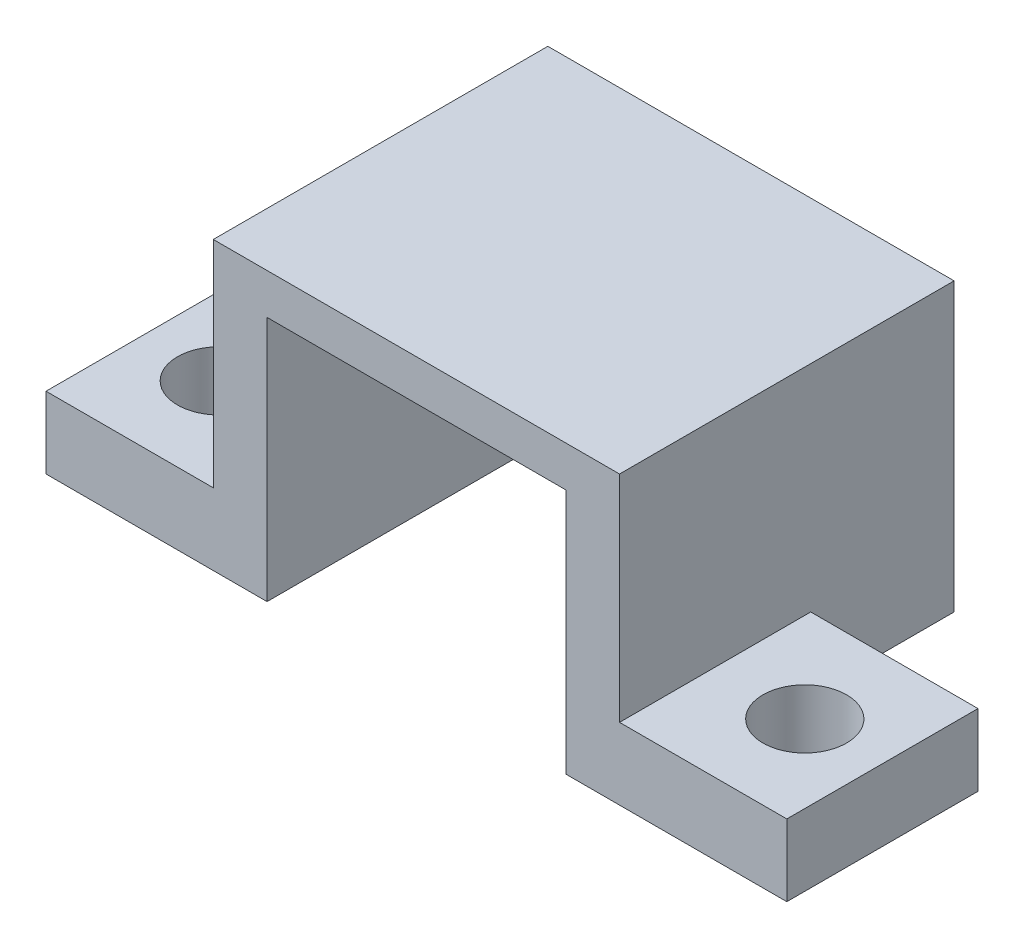
ISO-10303-21;
HEADER;
FILE_DESCRIPTION(('STEP AP214'),'2;1');
FILE_NAME('part.step','',(''),(''),'','','');
FILE_SCHEMA(('AUTOMOTIVE_DESIGN { 1 0 10303 214 1 1 1 1 }'));
ENDSEC;
DATA;
#1=APPLICATION_CONTEXT('core data for automotive mechanical design processes');
#2=APPLICATION_PROTOCOL_DEFINITION('international standard','automotive_design',2000,#1);
#3=PRODUCT_CONTEXT('',#1,'mechanical');
#4=PRODUCT('Part','Part','',(#3));
#5=PRODUCT_RELATED_PRODUCT_CATEGORY('part','',(#4));
#6=PRODUCT_DEFINITION_FORMATION('','',#4);
#7=PRODUCT_DEFINITION_CONTEXT('part definition',#1,'design');
#8=PRODUCT_DEFINITION('design','',#6,#7);
#9=PRODUCT_DEFINITION_SHAPE('','',#8);
#10=(LENGTH_UNIT() NAMED_UNIT(*) SI_UNIT(.MILLI.,.METRE.));
#11=(NAMED_UNIT(*) PLANE_ANGLE_UNIT() SI_UNIT($,.RADIAN.));
#12=(NAMED_UNIT(*) SI_UNIT($,.STERADIAN.) SOLID_ANGLE_UNIT());
#13=UNCERTAINTY_MEASURE_WITH_UNIT(LENGTH_MEASURE(1.E-05),#10,'distance_accuracy_value','');
#14=(GEOMETRIC_REPRESENTATION_CONTEXT(3) GLOBAL_UNCERTAINTY_ASSIGNED_CONTEXT((#13)) GLOBAL_UNIT_ASSIGNED_CONTEXT((#10,
#11,#12)) REPRESENTATION_CONTEXT('',''));
#15=CARTESIAN_POINT('',(0.,0.,0.));
#16=DIRECTION('',(0.,0.,1.));
#17=DIRECTION('',(1.,0.,0.));
#18=AXIS2_PLACEMENT_3D('',#15,#16,#17);
#19=CARTESIAN_POINT('',(0.,5.00000041370185E-05,0.));
#20=DIRECTION('',(0.,-1.,0.));
#21=DIRECTION('',(0.,0.,-1.));
#22=AXIS2_PLACEMENT_3D('',#19,#20,#21);
#23=PLANE('',#22);
#24=CARTESIAN_POINT('',(3.25002521276474,5.00000041370185E-05,10.0000251680613));
#25=DIRECTION('',(0.,-1.,0.));
#26=DIRECTION('',(0.,0.,-1.));
#27=AXIS2_PLACEMENT_3D('',#24,#25,#26);
#28=CIRCLE('',#27,1.75);
#29=CARTESIAN_POINT('',(3.25002521276474,5.00000041370185E-05,8.25002516806126));
#30=VERTEX_POINT('',#29);
#31=EDGE_CURVE('E161',#30,#30,#28,.T.);
#32=ORIENTED_EDGE('',*,*,#31,.F.);
#33=EDGE_LOOP('',(#32));
#34=FACE_BOUND('',#33,.T.);
#35=DIRECTION('',(0.,0.,1.));
#36=VECTOR('',#35,1.);
#37=CARTESIAN_POINT('',(9.25002433359623,5.00000041370185E-05,2.46800482273102E-05));
#38=LINE('',#37,#36);
#39=CARTESIAN_POINT('',(9.25002433359623,5.00000041370185E-05,2.46800482273102E-05));
#40=VERTEX_POINT('',#39);
#41=CARTESIAN_POINT('',(9.25002433359623,5.00000041370185E-05,14.0000246465206));
#42=VERTEX_POINT('',#41);
#43=EDGE_CURVE('E208',#40,#42,#38,.T.);
#44=ORIENTED_EDGE('',*,*,#43,.T.);
#45=DIRECTION('',(-1.,0.,0.));
#46=VECTOR('',#45,1.);
#47=CARTESIAN_POINT('',(24.0000262856483,5.00000041370185E-05,14.0000246465206));
#48=LINE('',#47,#46);
#49=CARTESIAN_POINT('',(2.51457095146179E-05,5.00000041369643E-05,14.0000246465206));
#50=VERTEX_POINT('',#49);
#51=EDGE_CURVE('E242',#42,#50,#48,.T.);
#52=ORIENTED_EDGE('',*,*,#51,.T.);
#53=DIRECTION('',(0.,0.,1.));
#54=VECTOR('',#53,1.);
#55=CARTESIAN_POINT('',(2.51457095146179E-05,5.00000041369643E-05,14.0000246465206));
#56=LINE('',#55,#54);
#57=CARTESIAN_POINT('',(2.51457095154853E-05,5.00000041368017E-05,6.00002473220229));
#58=VERTEX_POINT('',#57);
#59=EDGE_CURVE('E178',#58,#50,#56,.T.);
#60=ORIENTED_EDGE('',*,*,#59,.F.);
#61=DIRECTION('',(1.,0.,0.));
#62=VECTOR('',#61,1.);
#63=CARTESIAN_POINT('',(2.51457095154853E-05,5.00000041368017E-05,6.00002473220229));
#64=LINE('',#63,#62);
#65=CARTESIAN_POINT('',(7.00002443045378,5.00000041368017E-05,6.00002473220229));
#66=VERTEX_POINT('',#65);
#67=EDGE_CURVE('E191',#58,#66,#64,.T.);
#68=ORIENTED_EDGE('',*,*,#67,.T.);
#69=DIRECTION('',(0.,0.,-1.));
#70=VECTOR('',#69,1.);
#71=CARTESIAN_POINT('',(7.00002443045378,5.00000041370185E-05,14.0000246465206));
#72=LINE('',#71,#70);
#73=CARTESIAN_POINT('',(7.00002443045378,5.00000041370185E-05,2.46800482273102E-05));
#74=VERTEX_POINT('',#73);
#75=EDGE_CURVE('E228',#66,#74,#72,.T.);
#76=ORIENTED_EDGE('',*,*,#75,.T.);
#77=DIRECTION('',(1.,0.,0.));
#78=VECTOR('',#77,1.);
#79=CARTESIAN_POINT('',(7.00002443045378,5.00000041370185E-05,2.46800482273102E-05));
#80=LINE('',#79,#78);
#81=EDGE_CURVE('E237',#74,#40,#80,.T.);
#82=ORIENTED_EDGE('',*,*,#81,.T.);
#83=EDGE_LOOP('',(#44,#52,#60,#68,#76,#82));
#84=FACE_BOUND('',#83,.T.);
#85=ADVANCED_FACE('F34',(#34,#84),#23,.T.);
#86=CARTESIAN_POINT('',(7.00002443045378,12.0000503957272,2.46800482273102E-05));
#87=DIRECTION('',(0.,0.,-1.));
#88=DIRECTION('',(-1.,0.,0.));
#89=AXIS2_PLACEMENT_3D('',#86,#87,#88);
#90=PLANE('',#89);
#91=DIRECTION('',(0.,-1.,0.));
#92=VECTOR('',#91,1.);
#93=CARTESIAN_POINT('',(9.25002433359623,10.3000504896045,2.46800482273102E-05));
#94=LINE('',#93,#92);
#95=CARTESIAN_POINT('',(9.25002433359623,10.3000504896045,2.46800482273102E-05));
#96=VERTEX_POINT('',#95);
#97=EDGE_CURVE('E198',#96,#40,#94,.T.);
#98=ORIENTED_EDGE('',*,*,#97,.T.);
#99=ORIENTED_EDGE('',*,*,#81,.F.);
#100=DIRECTION('',(0.,-1.,0.));
#101=VECTOR('',#100,1.);
#102=CARTESIAN_POINT('',(7.00002443045378,12.0000503957272,2.46800482273102E-05));
#103=LINE('',#102,#101);
#104=CARTESIAN_POINT('',(7.00002443045378,12.0000503957272,2.46800482273102E-05));
#105=VERTEX_POINT('',#104);
#106=EDGE_CURVE('E11',#105,#74,#103,.T.);
#107=ORIENTED_EDGE('',*,*,#106,.F.);
#108=DIRECTION('',(1.,0.,0.));
#109=VECTOR('',#108,1.);
#110=CARTESIAN_POINT('',(7.00002443045378,12.0000503957272,2.46800482273102E-05));
#111=LINE('',#110,#109);
#112=CARTESIAN_POINT('',(24.0000262856483,12.0000503957272,2.46800482273102E-05));
#113=VERTEX_POINT('',#112);
#114=EDGE_CURVE('E224',#105,#113,#111,.T.);
#115=ORIENTED_EDGE('',*,*,#114,.T.);
#116=DIRECTION('',(0.,-1.,0.));
#117=VECTOR('',#116,1.);
#118=CARTESIAN_POINT('',(24.0000262856483,12.0000503957272,2.46800482273102E-05));
#119=LINE('',#118,#117);
#120=CARTESIAN_POINT('',(24.0000262856483,5.00000041370185E-05,2.46800482273102E-05));
#121=VERTEX_POINT('',#120);
#122=EDGE_CURVE('E236',#113,#121,#119,.T.);
#123=ORIENTED_EDGE('',*,*,#122,.T.);
#124=CARTESIAN_POINT('',(21.7500254511833,5.00000041370185E-05,2.46800482273102E-05));
#125=VERTEX_POINT('',#124);
#126=EDGE_CURVE('E217',#125,#121,#80,.T.);
#127=ORIENTED_EDGE('',*,*,#126,.F.);
#128=DIRECTION('',(0.,1.,0.));
#129=VECTOR('',#128,1.);
#130=CARTESIAN_POINT('',(21.7500254511833,5.00000041369914E-05,2.46800482273102E-05));
#131=LINE('',#130,#129);
#132=CARTESIAN_POINT('',(21.7500254511833,10.3000504896045,2.46800482273102E-05));
#133=VERTEX_POINT('',#132);
#134=EDGE_CURVE('E201',#125,#133,#131,.T.);
#135=ORIENTED_EDGE('',*,*,#134,.T.);
#136=DIRECTION('',(-1.,0.,0.));
#137=VECTOR('',#136,1.);
#138=CARTESIAN_POINT('',(21.7500254511833,10.3000504896045,2.46800482273102E-05));
#139=LINE('',#138,#137);
#140=EDGE_CURVE('E205',#133,#96,#139,.T.);
#141=ORIENTED_EDGE('',*,*,#140,.T.);
#142=EDGE_LOOP('',(#98,#99,#107,#115,#123,#127,#135,#141));
#143=FACE_BOUND('',#142,.T.);
#144=ADVANCED_FACE('F36',(#143),#90,.T.);
#145=CARTESIAN_POINT('',(7.00002443045378,12.0000503957272,14.0000246465206));
#146=DIRECTION('',(-1.,0.,0.));
#147=DIRECTION('',(0.,0.,1.));
#148=AXIS2_PLACEMENT_3D('',#145,#146,#147);
#149=PLANE('',#148);
#150=DIRECTION('',(0.,0.,-1.));
#151=VECTOR('',#150,1.);
#152=CARTESIAN_POINT('',(7.00002443045378,3.00005008466542,6.00002473220229));
#153=LINE('',#152,#151);
#154=CARTESIAN_POINT('',(7.00002443045378,3.00005008466542,14.0000246465206));
#155=VERTEX_POINT('',#154);
#156=CARTESIAN_POINT('',(7.00002443045378,3.00005008466542,6.00002473220229));
#157=VERTEX_POINT('',#156);
#158=EDGE_CURVE('E184',#155,#157,#153,.T.);
#159=ORIENTED_EDGE('',*,*,#158,.F.);
#160=DIRECTION('',(0.,-1.,0.));
#161=VECTOR('',#160,1.);
#162=CARTESIAN_POINT('',(7.00002443045378,12.0000503957272,14.0000246465206));
#163=LINE('',#162,#161);
#164=CARTESIAN_POINT('',(7.00002443045378,12.0000503957272,14.0000246465206));
#165=VERTEX_POINT('',#164);
#166=EDGE_CURVE('E43',#165,#155,#163,.T.);
#167=ORIENTED_EDGE('',*,*,#166,.F.);
#168=DIRECTION('',(0.,0.,-1.));
#169=VECTOR('',#168,1.);
#170=CARTESIAN_POINT('',(7.00002443045378,12.0000503957272,14.0000246465206));
#171=LINE('',#170,#169);
#172=EDGE_CURVE('E233',#165,#105,#171,.T.);
#173=ORIENTED_EDGE('',*,*,#172,.T.);
#174=ORIENTED_EDGE('',*,*,#106,.T.);
#175=ORIENTED_EDGE('',*,*,#75,.F.);
#176=DIRECTION('',(0.,-1.,0.));
#177=VECTOR('',#176,1.);
#178=CARTESIAN_POINT('',(7.00002443045378,5.00000041368017E-05,6.00002473220229));
#179=LINE('',#178,#177);
#180=EDGE_CURVE('E176',#157,#66,#179,.T.);
#181=ORIENTED_EDGE('',*,*,#180,.F.);
#182=EDGE_LOOP('',(#159,#167,#173,#174,#175,#181));
#183=FACE_BOUND('',#182,.T.);
#184=ADVANCED_FACE('F277',(#183),#149,.T.);
#185=CARTESIAN_POINT('',(24.0000262856483,12.0000503957272,14.0000246465206));
#186=DIRECTION('',(0.,0.,1.));
#187=DIRECTION('',(1.,0.,0.));
#188=AXIS2_PLACEMENT_3D('',#185,#186,#187);
#189=PLANE('',#188);
#190=DIRECTION('',(0.,-1.,0.));
#191=VECTOR('',#190,1.);
#192=CARTESIAN_POINT('',(9.25002433359623,10.3000504896045,14.0000246465206));
#193=LINE('',#192,#191);
#194=CARTESIAN_POINT('',(9.25002433359623,10.3000504896045,14.0000246465206));
#195=VERTEX_POINT('',#194);
#196=EDGE_CURVE('E197',#195,#42,#193,.T.);
#197=ORIENTED_EDGE('',*,*,#196,.F.);
#198=DIRECTION('',(-1.,0.,0.));
#199=VECTOR('',#198,1.);
#200=CARTESIAN_POINT('',(21.7500254511833,10.3000504896045,14.0000246465206));
#201=LINE('',#200,#199);
#202=CARTESIAN_POINT('',(21.7500254511833,10.3000504896045,14.0000246465206));
#203=VERTEX_POINT('',#202);
#204=EDGE_CURVE('E202',#203,#195,#201,.T.);
#205=ORIENTED_EDGE('',*,*,#204,.F.);
#206=DIRECTION('',(0.,1.,0.));
#207=VECTOR('',#206,1.);
#208=CARTESIAN_POINT('',(21.7500254511833,5.00000041369914E-05,14.0000246465206));
#209=LINE('',#208,#207);
#210=CARTESIAN_POINT('',(21.7500254511833,5.00000041369914E-05,14.0000246465206));
#211=VERTEX_POINT('',#210);
#212=EDGE_CURVE('E210',#211,#203,#209,.T.);
#213=ORIENTED_EDGE('',*,*,#212,.F.);
#214=CARTESIAN_POINT('',(31.0000255703926,5.00000041370185E-05,14.0000246465206));
#215=VERTEX_POINT('',#214);
#216=EDGE_CURVE('E145',#215,#211,#48,.T.);
#217=ORIENTED_EDGE('',*,*,#216,.F.);
#218=DIRECTION('',(0.,-1.,0.));
#219=VECTOR('',#218,1.);
#220=CARTESIAN_POINT('',(31.0000255703926,5.00000041370185E-05,14.0000246465206));
#221=LINE('',#220,#219);
#222=CARTESIAN_POINT('',(31.0000255703926,3.00005008466542,14.0000246465206));
#223=VERTEX_POINT('',#222);
#224=EDGE_CURVE('E136',#223,#215,#221,.T.);
#225=ORIENTED_EDGE('',*,*,#224,.F.);
#226=DIRECTION('',(-1.,0.,0.));
#227=VECTOR('',#226,1.);
#228=CARTESIAN_POINT('',(31.0000255703926,3.00005008466542,14.0000246465206));
#229=LINE('',#228,#227);
#230=CARTESIAN_POINT('',(24.0000262856483,3.00005008466542,14.0000246465206));
#231=VERTEX_POINT('',#230);
#232=EDGE_CURVE('E141',#223,#231,#229,.T.);
#233=ORIENTED_EDGE('',*,*,#232,.T.);
#234=DIRECTION('',(0.,-1.,0.));
#235=VECTOR('',#234,1.);
#236=CARTESIAN_POINT('',(24.0000262856483,12.0000503957272,14.0000246465206));
#237=LINE('',#236,#235);
#238=CARTESIAN_POINT('',(24.0000262856483,12.0000503957272,14.0000246465206));
#239=VERTEX_POINT('',#238);
#240=EDGE_CURVE('E51',#239,#231,#237,.T.);
#241=ORIENTED_EDGE('',*,*,#240,.F.);
#242=DIRECTION('',(-1.,0.,0.));
#243=VECTOR('',#242,1.);
#244=CARTESIAN_POINT('',(24.0000262856483,12.0000503957272,14.0000246465206));
#245=LINE('',#244,#243);
#246=EDGE_CURVE('E230',#239,#165,#245,.T.);
#247=ORIENTED_EDGE('',*,*,#246,.T.);
#248=ORIENTED_EDGE('',*,*,#166,.T.);
#249=DIRECTION('',(1.,0.,0.));
#250=VECTOR('',#249,1.);
#251=CARTESIAN_POINT('',(2.51457095146179E-05,3.00005008466542,14.0000246465206));
#252=LINE('',#251,#250);
#253=CARTESIAN_POINT('',(2.51457095146179E-05,3.00005008466542,14.0000246465206));
#254=VERTEX_POINT('',#253);
#255=EDGE_CURVE('E183',#254,#155,#252,.T.);
#256=ORIENTED_EDGE('',*,*,#255,.F.);
#257=DIRECTION('',(0.,1.,0.));
#258=VECTOR('',#257,1.);
#259=CARTESIAN_POINT('',(2.51457095146179E-05,3.00005008466542,14.0000246465206));
#260=LINE('',#259,#258);
#261=EDGE_CURVE('E181',#50,#254,#260,.T.);
#262=ORIENTED_EDGE('',*,*,#261,.F.);
#263=ORIENTED_EDGE('',*,*,#51,.F.);
#264=EDGE_LOOP('',(#197,#205,#213,#217,#225,#233,#241,#247,#248,#256,#262,#263));
#265=FACE_BOUND('',#264,.T.);
#266=ADVANCED_FACE('F139',(#265),#189,.T.);
#267=CARTESIAN_POINT('',(24.0000262856483,12.0000503957272,2.46800482273102E-05));
#268=DIRECTION('',(1.,0.,0.));
#269=DIRECTION('',(0.,0.,-1.));
#270=AXIS2_PLACEMENT_3D('',#267,#268,#269);
#271=PLANE('',#270);
#272=DIRECTION('',(0.,0.,1.));
#273=VECTOR('',#272,1.);
#274=CARTESIAN_POINT('',(24.0000262856483,3.00005008466542,14.0000246465206));
#275=LINE('',#274,#273);
#276=CARTESIAN_POINT('',(24.0000262856483,3.00005008466542,6.00002473220229));
#277=VERTEX_POINT('',#276);
#278=EDGE_CURVE('E160',#277,#231,#275,.T.);
#279=ORIENTED_EDGE('',*,*,#278,.F.);
#280=DIRECTION('',(0.,1.,0.));
#281=VECTOR('',#280,1.);
#282=CARTESIAN_POINT('',(24.0000262856483,3.00005008466542,6.00002473220229));
#283=LINE('',#282,#281);
#284=CARTESIAN_POINT('',(24.0000262856483,5.00000041370185E-05,6.00002473220229));
#285=VERTEX_POINT('',#284);
#286=EDGE_CURVE('E57',#285,#277,#283,.T.);
#287=ORIENTED_EDGE('',*,*,#286,.F.);
#288=DIRECTION('',(0.,0.,1.));
#289=VECTOR('',#288,1.);
#290=CARTESIAN_POINT('',(24.0000262856483,5.00000041370185E-05,2.46800482273102E-05));
#291=LINE('',#290,#289);
#292=EDGE_CURVE('E240',#121,#285,#291,.T.);
#293=ORIENTED_EDGE('',*,*,#292,.F.);
#294=ORIENTED_EDGE('',*,*,#122,.F.);
#295=DIRECTION('',(0.,0.,1.));
#296=VECTOR('',#295,1.);
#297=CARTESIAN_POINT('',(24.0000262856483,12.0000503957272,2.46800482273102E-05));
#298=LINE('',#297,#296);
#299=EDGE_CURVE('E227',#113,#239,#298,.T.);
#300=ORIENTED_EDGE('',*,*,#299,.T.);
#301=ORIENTED_EDGE('',*,*,#240,.T.);
#302=EDGE_LOOP('',(#279,#287,#293,#294,#300,#301));
#303=FACE_BOUND('',#302,.T.);
#304=ADVANCED_FACE('F294',(#303),#271,.T.);
#305=CARTESIAN_POINT('',(0.,12.0000503957272,0.));
#306=DIRECTION('',(0.,-1.,0.));
#307=DIRECTION('',(0.,0.,-1.));
#308=AXIS2_PLACEMENT_3D('',#305,#306,#307);
#309=PLANE('',#308);
#310=ORIENTED_EDGE('',*,*,#114,.F.);
#311=ORIENTED_EDGE('',*,*,#172,.F.);
#312=ORIENTED_EDGE('',*,*,#246,.F.);
#313=ORIENTED_EDGE('',*,*,#299,.F.);
#314=EDGE_LOOP('',(#310,#311,#312,#313));
#315=FACE_BOUND('',#314,.T.);
#316=ADVANCED_FACE('F285',(#315),#309,.F.);
#317=CARTESIAN_POINT('',(27.7513756752014,5.00000041370185E-05,10.0000251680613));
#318=DIRECTION('',(0.,-1.,0.));
#319=DIRECTION('',(0.,0.,-1.));
#320=AXIS2_PLACEMENT_3D('',#317,#318,#319);
#321=CIRCLE('',#320,1.75);
#322=CARTESIAN_POINT('',(27.7513756752014,5.00000041370185E-05,8.25002516806126));
#323=VERTEX_POINT('',#322);
#324=EDGE_CURVE('E299',#323,#323,#321,.T.);
#325=ORIENTED_EDGE('',*,*,#324,.F.);
#326=EDGE_LOOP('',(#325));
#327=FACE_BOUND('',#326,.T.);
#328=DIRECTION('',(0.,0.,1.));
#329=VECTOR('',#328,1.);
#330=CARTESIAN_POINT('',(21.7500254511833,5.00000041369914E-05,2.46800482273102E-05));
#331=LINE('',#330,#329);
#332=EDGE_CURVE('E220',#125,#211,#331,.T.);
#333=ORIENTED_EDGE('',*,*,#332,.F.);
#334=ORIENTED_EDGE('',*,*,#126,.T.);
#335=ORIENTED_EDGE('',*,*,#292,.T.);
#336=DIRECTION('',(-1.,0.,0.));
#337=VECTOR('',#336,1.);
#338=CARTESIAN_POINT('',(31.0000255703926,5.00000041369643E-05,6.00002473220229));
#339=LINE('',#338,#337);
#340=CARTESIAN_POINT('',(31.0000255703926,5.00000041369643E-05,6.00002473220229));
#341=VERTEX_POINT('',#340);
#342=EDGE_CURVE('E162',#341,#285,#339,.T.);
#343=ORIENTED_EDGE('',*,*,#342,.F.);
#344=DIRECTION('',(0.,0.,-1.));
#345=VECTOR('',#344,1.);
#346=CARTESIAN_POINT('',(31.0000255703926,5.00000041369643E-05,6.00002473220229));
#347=LINE('',#346,#345);
#348=EDGE_CURVE('E148',#215,#341,#347,.T.);
#349=ORIENTED_EDGE('',*,*,#348,.F.);
#350=ORIENTED_EDGE('',*,*,#216,.T.);
#351=EDGE_LOOP('',(#333,#334,#335,#343,#349,#350));
#352=FACE_BOUND('',#351,.T.);
#353=ADVANCED_FACE('F273',(#327,#352),#23,.T.);
#354=CARTESIAN_POINT('',(9.25002433359623,10.3000504896045,2.46800482273102E-05));
#355=DIRECTION('',(-1.,0.,0.));
#356=DIRECTION('',(0.,0.,1.));
#357=AXIS2_PLACEMENT_3D('',#354,#355,#356);
#358=PLANE('',#357);
#359=ORIENTED_EDGE('',*,*,#196,.T.);
#360=ORIENTED_EDGE('',*,*,#43,.F.);
#361=ORIENTED_EDGE('',*,*,#97,.F.);
#362=DIRECTION('',(0.,0.,1.));
#363=VECTOR('',#362,1.);
#364=CARTESIAN_POINT('',(9.25002433359623,10.3000504896045,2.46800482273102E-05));
#365=LINE('',#364,#363);
#366=EDGE_CURVE('E215',#96,#195,#365,.T.);
#367=ORIENTED_EDGE('',*,*,#366,.T.);
#368=EDGE_LOOP('',(#359,#360,#361,#367));
#369=FACE_BOUND('',#368,.T.);
#370=ADVANCED_FACE('F284',(#369),#358,.F.);
#371=CARTESIAN_POINT('',(21.7500254511833,10.3000504896045,2.46800482273102E-05));
#372=DIRECTION('',(0.,1.,0.));
#373=DIRECTION('',(0.,0.,1.));
#374=AXIS2_PLACEMENT_3D('',#371,#372,#373);
#375=PLANE('',#374);
#376=ORIENTED_EDGE('',*,*,#204,.T.);
#377=ORIENTED_EDGE('',*,*,#366,.F.);
#378=ORIENTED_EDGE('',*,*,#140,.F.);
#379=DIRECTION('',(0.,0.,1.));
#380=VECTOR('',#379,1.);
#381=CARTESIAN_POINT('',(21.7500254511833,10.3000504896045,2.46800482273102E-05));
#382=LINE('',#381,#380);
#383=EDGE_CURVE('E218',#133,#203,#382,.T.);
#384=ORIENTED_EDGE('',*,*,#383,.T.);
#385=EDGE_LOOP('',(#376,#377,#378,#384));
#386=FACE_BOUND('',#385,.T.);
#387=ADVANCED_FACE('F291',(#386),#375,.F.);
#388=CARTESIAN_POINT('',(21.7500254511833,5.00000041369914E-05,2.46800482273102E-05));
#389=DIRECTION('',(1.,0.,0.));
#390=DIRECTION('',(0.,0.,-1.));
#391=AXIS2_PLACEMENT_3D('',#388,#389,#390);
#392=PLANE('',#391);
#393=ORIENTED_EDGE('',*,*,#212,.T.);
#394=ORIENTED_EDGE('',*,*,#383,.F.);
#395=ORIENTED_EDGE('',*,*,#134,.F.);
#396=ORIENTED_EDGE('',*,*,#332,.T.);
#397=EDGE_LOOP('',(#393,#394,#395,#396));
#398=FACE_BOUND('',#397,.T.);
#399=ADVANCED_FACE('F392',(#398),#392,.F.);
#400=CARTESIAN_POINT('',(2.51457095154853E-05,3.00005008466542,6.00002473220229));
#401=DIRECTION('',(0.,-1.,0.));
#402=DIRECTION('',(0.,0.,-1.));
#403=AXIS2_PLACEMENT_3D('',#400,#401,#402);
#404=PLANE('',#403);
#405=CARTESIAN_POINT('',(3.25002521276474,3.00005008466542,10.0000251680613));
#406=DIRECTION('',(0.,-1.,0.));
#407=DIRECTION('',(0.,0.,-1.));
#408=AXIS2_PLACEMENT_3D('',#405,#406,#407);
#409=CIRCLE('',#408,1.75);
#410=CARTESIAN_POINT('',(3.25002521276474,3.00005008466542,8.25002516806126));
#411=VERTEX_POINT('',#410);
#412=EDGE_CURVE('E165',#411,#411,#409,.T.);
#413=ORIENTED_EDGE('',*,*,#412,.T.);
#414=EDGE_LOOP('',(#413));
#415=FACE_BOUND('',#414,.T.);
#416=ORIENTED_EDGE('',*,*,#158,.T.);
#417=DIRECTION('',(1.,0.,0.));
#418=VECTOR('',#417,1.);
#419=CARTESIAN_POINT('',(2.51457095154853E-05,3.00005008466542,6.00002473220229));
#420=LINE('',#419,#418);
#421=CARTESIAN_POINT('',(2.51457095154853E-05,3.00005008466542,6.00002473220229));
#422=VERTEX_POINT('',#421);
#423=EDGE_CURVE('E194',#422,#157,#420,.T.);
#424=ORIENTED_EDGE('',*,*,#423,.F.);
#425=DIRECTION('',(0.,0.,-1.));
#426=VECTOR('',#425,1.);
#427=CARTESIAN_POINT('',(2.51457095154853E-05,3.00005008466542,6.00002473220229));
#428=LINE('',#427,#426);
#429=EDGE_CURVE('E172',#254,#422,#428,.T.);
#430=ORIENTED_EDGE('',*,*,#429,.F.);
#431=ORIENTED_EDGE('',*,*,#255,.T.);
#432=EDGE_LOOP('',(#416,#424,#430,#431));
#433=FACE_BOUND('',#432,.T.);
#434=ADVANCED_FACE('F252',(#415,#433),#404,.F.);
#435=CARTESIAN_POINT('',(2.51457095154853E-05,5.00000041368017E-05,6.00002473220229));
#436=DIRECTION('',(0.,0.,1.));
#437=DIRECTION('',(1.,0.,0.));
#438=AXIS2_PLACEMENT_3D('',#435,#436,#437);
#439=PLANE('',#438);
#440=ORIENTED_EDGE('',*,*,#180,.T.);
#441=ORIENTED_EDGE('',*,*,#67,.F.);
#442=DIRECTION('',(0.,-1.,0.));
#443=VECTOR('',#442,1.);
#444=CARTESIAN_POINT('',(2.51457095154853E-05,5.00000041368017E-05,6.00002473220229));
#445=LINE('',#444,#443);
#446=EDGE_CURVE('E175',#422,#58,#445,.T.);
#447=ORIENTED_EDGE('',*,*,#446,.F.);
#448=ORIENTED_EDGE('',*,*,#423,.T.);
#449=EDGE_LOOP('',(#440,#441,#447,#448));
#450=FACE_BOUND('',#449,.T.);
#451=ADVANCED_FACE('F267',(#450),#439,.F.);
#452=CARTESIAN_POINT('',(2.51457095163526E-05,0.,0.));
#453=DIRECTION('',(1.,0.,0.));
#454=DIRECTION('',(0.,0.,-1.));
#455=AXIS2_PLACEMENT_3D('',#452,#453,#454);
#456=PLANE('',#455);
#457=ORIENTED_EDGE('',*,*,#429,.T.);
#458=ORIENTED_EDGE('',*,*,#446,.T.);
#459=ORIENTED_EDGE('',*,*,#59,.T.);
#460=ORIENTED_EDGE('',*,*,#261,.T.);
#461=EDGE_LOOP('',(#457,#458,#459,#460));
#462=FACE_BOUND('',#461,.T.);
#463=ADVANCED_FACE('F257',(#462),#456,.F.);
#464=CARTESIAN_POINT('',(3.25002521276474,12.0000503957272,10.0000251680613));
#465=DIRECTION('',(0.,-1.,0.));
#466=DIRECTION('',(0.,0.,-1.));
#467=AXIS2_PLACEMENT_3D('',#464,#465,#466);
#468=CYLINDRICAL_SURFACE('',#467,1.75);
#469=ORIENTED_EDGE('',*,*,#31,.T.);
#470=EDGE_LOOP('',(#469));
#471=FACE_BOUND('',#470,.T.);
#472=ORIENTED_EDGE('',*,*,#412,.F.);
#473=EDGE_LOOP('',(#472));
#474=FACE_BOUND('',#473,.T.);
#475=ADVANCED_FACE('F255',(#471,#474),#468,.F.);
#476=CARTESIAN_POINT('',(31.0000255703926,3.00005008466542,14.0000246465206));
#477=DIRECTION('',(0.,-1.,0.));
#478=DIRECTION('',(0.,0.,-1.));
#479=AXIS2_PLACEMENT_3D('',#476,#477,#478);
#480=PLANE('',#479);
#481=CARTESIAN_POINT('',(27.7513756752014,3.00005008466542,10.0000251680613));
#482=DIRECTION('',(0.,-1.,0.));
#483=DIRECTION('',(0.,0.,-1.));
#484=AXIS2_PLACEMENT_3D('',#481,#482,#483);
#485=CIRCLE('',#484,1.75);
#486=CARTESIAN_POINT('',(27.7513756752014,3.00005008466542,8.25002516806126));
#487=VERTEX_POINT('',#486);
#488=EDGE_CURVE('E38',#487,#487,#485,.T.);
#489=ORIENTED_EDGE('',*,*,#488,.T.);
#490=EDGE_LOOP('',(#489));
#491=FACE_BOUND('',#490,.T.);
#492=ORIENTED_EDGE('',*,*,#278,.T.);
#493=ORIENTED_EDGE('',*,*,#232,.F.);
#494=DIRECTION('',(0.,0.,1.));
#495=VECTOR('',#494,1.);
#496=CARTESIAN_POINT('',(31.0000255703926,3.00005008466542,14.0000246465206));
#497=LINE('',#496,#495);
#498=CARTESIAN_POINT('',(31.0000255703926,3.00005008466542,6.00002473220229));
#499=VERTEX_POINT('',#498);
#500=EDGE_CURVE('E149',#499,#223,#497,.T.);
#501=ORIENTED_EDGE('',*,*,#500,.F.);
#502=DIRECTION('',(-1.,0.,0.));
#503=VECTOR('',#502,1.);
#504=CARTESIAN_POINT('',(31.0000255703926,3.00005008466542,6.00002473220229));
#505=LINE('',#504,#503);
#506=EDGE_CURVE('E168',#499,#277,#505,.T.);
#507=ORIENTED_EDGE('',*,*,#506,.T.);
#508=EDGE_LOOP('',(#492,#493,#501,#507));
#509=FACE_BOUND('',#508,.T.);
#510=ADVANCED_FACE('F159',(#491,#509),#480,.F.);
#511=CARTESIAN_POINT('',(31.0000255703926,3.00005008466542,6.00002473220229));
#512=DIRECTION('',(0.,0.,1.));
#513=DIRECTION('',(1.,0.,0.));
#514=AXIS2_PLACEMENT_3D('',#511,#512,#513);
#515=PLANE('',#514);
#516=ORIENTED_EDGE('',*,*,#286,.T.);
#517=ORIENTED_EDGE('',*,*,#506,.F.);
#518=DIRECTION('',(0.,1.,0.));
#519=VECTOR('',#518,1.);
#520=CARTESIAN_POINT('',(31.0000255703926,3.00005008466542,6.00002473220229));
#521=LINE('',#520,#519);
#522=EDGE_CURVE('E154',#341,#499,#521,.T.);
#523=ORIENTED_EDGE('',*,*,#522,.F.);
#524=ORIENTED_EDGE('',*,*,#342,.T.);
#525=EDGE_LOOP('',(#516,#517,#523,#524));
#526=FACE_BOUND('',#525,.T.);
#527=ADVANCED_FACE('F264',(#526),#515,.F.);
#528=CARTESIAN_POINT('',(31.0000255703926,0.,0.));
#529=DIRECTION('',(-1.,0.,0.));
#530=DIRECTION('',(0.,0.,1.));
#531=AXIS2_PLACEMENT_3D('',#528,#529,#530);
#532=PLANE('',#531);
#533=ORIENTED_EDGE('',*,*,#500,.T.);
#534=ORIENTED_EDGE('',*,*,#224,.T.);
#535=ORIENTED_EDGE('',*,*,#348,.T.);
#536=ORIENTED_EDGE('',*,*,#522,.T.);
#537=EDGE_LOOP('',(#533,#534,#535,#536));
#538=FACE_BOUND('',#537,.T.);
#539=ADVANCED_FACE('F152',(#538),#532,.F.);
#540=CARTESIAN_POINT('',(27.7513756752014,12.0000503957272,10.0000251680613));
#541=DIRECTION('',(0.,-1.,0.));
#542=DIRECTION('',(0.,0.,-1.));
#543=AXIS2_PLACEMENT_3D('',#540,#541,#542);
#544=CYLINDRICAL_SURFACE('',#543,1.75);
#545=ORIENTED_EDGE('',*,*,#324,.T.);
#546=EDGE_LOOP('',(#545));
#547=FACE_BOUND('',#546,.T.);
#548=ORIENTED_EDGE('',*,*,#488,.F.);
#549=EDGE_LOOP('',(#548));
#550=FACE_BOUND('',#549,.T.);
#551=ADVANCED_FACE('F315',(#547,#550),#544,.F.);
#552=CLOSED_SHELL('',(#85,#144,#184,#266,#304,#316,#353,#370,#387,#399,#434,#451,#463,#475,#510,
#527,#539,#551));
#553=MANIFOLD_SOLID_BREP('B2',#552);
#554=ADVANCED_BREP_SHAPE_REPRESENTATION('',(#18,#553),#14);
#555=SHAPE_DEFINITION_REPRESENTATION(#9,#554);
ENDSEC;
END-ISO-10303-21;
